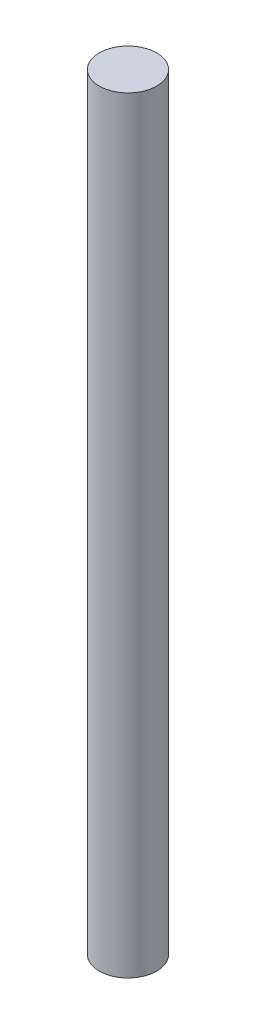
ISO-10303-21;
HEADER;
FILE_DESCRIPTION(('STEP AP214'),'2;1');
FILE_NAME('part.step','',(''),(''),'','','');
FILE_SCHEMA(('AUTOMOTIVE_DESIGN { 1 0 10303 214 1 1 1 1 }'));
ENDSEC;
DATA;
#1=APPLICATION_CONTEXT('core data for automotive mechanical design processes');
#2=APPLICATION_PROTOCOL_DEFINITION('international standard','automotive_design',2000,#1);
#3=PRODUCT_CONTEXT('',#1,'mechanical');
#4=PRODUCT('Part','Part','',(#3));
#5=PRODUCT_RELATED_PRODUCT_CATEGORY('part','',(#4));
#6=PRODUCT_DEFINITION_FORMATION('','',#4);
#7=PRODUCT_DEFINITION_CONTEXT('part definition',#1,'design');
#8=PRODUCT_DEFINITION('design','',#6,#7);
#9=PRODUCT_DEFINITION_SHAPE('','',#8);
#10=(LENGTH_UNIT() NAMED_UNIT(*) SI_UNIT(.MILLI.,.METRE.));
#11=(NAMED_UNIT(*) PLANE_ANGLE_UNIT() SI_UNIT($,.RADIAN.));
#12=(NAMED_UNIT(*) SI_UNIT($,.STERADIAN.) SOLID_ANGLE_UNIT());
#13=UNCERTAINTY_MEASURE_WITH_UNIT(LENGTH_MEASURE(1.E-05),#10,'distance_accuracy_value','');
#14=(GEOMETRIC_REPRESENTATION_CONTEXT(3) GLOBAL_UNCERTAINTY_ASSIGNED_CONTEXT((#13)) GLOBAL_UNIT_ASSIGNED_CONTEXT((#10,
#11,#12)) REPRESENTATION_CONTEXT('',''));
#15=CARTESIAN_POINT('',(0.,0.,0.));
#16=DIRECTION('',(0.,0.,1.));
#17=DIRECTION('',(1.,0.,0.));
#18=AXIS2_PLACEMENT_3D('',#15,#16,#17);
#19=CARTESIAN_POINT('',(0.,40.,0.));
#20=DIRECTION('',(0.,-1.,0.));
#21=DIRECTION('',(0.,0.,-1.));
#22=AXIS2_PLACEMENT_3D('',#19,#20,#21);
#23=CYLINDRICAL_SURFACE('',#22,1.5);
#24=CARTESIAN_POINT('',(0.,40.,0.));
#25=DIRECTION('',(0.,1.,0.));
#26=DIRECTION('',(0.,0.,1.));
#27=AXIS2_PLACEMENT_3D('',#24,#25,#26);
#28=CIRCLE('',#27,1.5);
#29=CARTESIAN_POINT('',(0.,40.,1.5));
#30=VERTEX_POINT('',#29);
#31=EDGE_CURVE('E10',#30,#30,#28,.T.);
#32=ORIENTED_EDGE('',*,*,#31,.F.);
#33=EDGE_LOOP('',(#32));
#34=FACE_BOUND('',#33,.T.);
#35=CARTESIAN_POINT('',(0.,0.,0.));
#36=DIRECTION('',(0.,1.,0.));
#37=DIRECTION('',(0.,0.,1.));
#38=AXIS2_PLACEMENT_3D('',#35,#36,#37);
#39=CIRCLE('',#38,1.5);
#40=CARTESIAN_POINT('',(0.,0.,1.5));
#41=VERTEX_POINT('',#40);
#42=EDGE_CURVE('E34',#41,#41,#39,.T.);
#43=ORIENTED_EDGE('',*,*,#42,.T.);
#44=EDGE_LOOP('',(#43));
#45=FACE_BOUND('',#44,.T.);
#46=ADVANCED_FACE('F31',(#34,#45),#23,.T.);
#47=CARTESIAN_POINT('',(0.,40.,0.));
#48=DIRECTION('',(0.,1.,0.));
#49=DIRECTION('',(0.,0.,1.));
#50=AXIS2_PLACEMENT_3D('',#47,#48,#49);
#51=PLANE('',#50);
#52=ORIENTED_EDGE('',*,*,#31,.T.);
#53=EDGE_LOOP('',(#52));
#54=FACE_BOUND('',#53,.T.);
#55=ADVANCED_FACE('F46',(#54),#51,.T.);
#56=CARTESIAN_POINT('',(0.,0.,0.));
#57=DIRECTION('',(0.,1.,0.));
#58=DIRECTION('',(0.,0.,1.));
#59=AXIS2_PLACEMENT_3D('',#56,#57,#58);
#60=PLANE('',#59);
#61=ORIENTED_EDGE('',*,*,#42,.F.);
#62=EDGE_LOOP('',(#61));
#63=FACE_BOUND('',#62,.T.);
#64=ADVANCED_FACE('F44',(#63),#60,.F.);
#65=CLOSED_SHELL('',(#46,#55,#64));
#66=MANIFOLD_SOLID_BREP('B2',#65);
#67=ADVANCED_BREP_SHAPE_REPRESENTATION('',(#18,#66),#14);
#68=SHAPE_DEFINITION_REPRESENTATION(#9,#67);
ENDSEC;
END-ISO-10303-21;
